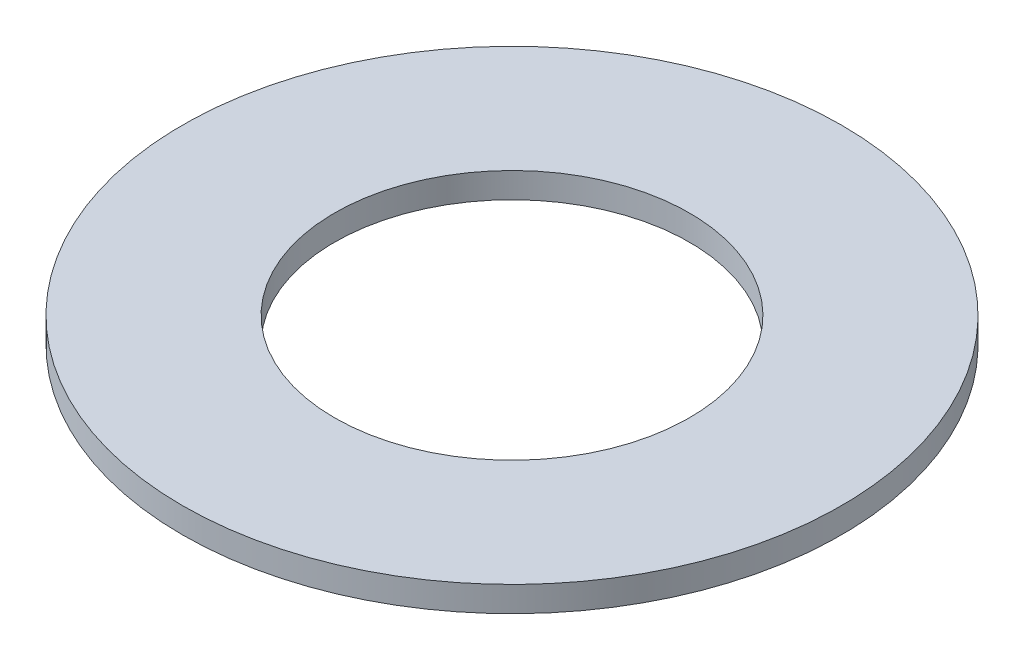
ISO-10303-21;
HEADER;
FILE_DESCRIPTION(('STEP AP214'),'2;1');
FILE_NAME('part.step','',(''),(''),'','','');
FILE_SCHEMA(('AUTOMOTIVE_DESIGN { 1 0 10303 214 1 1 1 1 }'));
ENDSEC;
DATA;
#1=APPLICATION_CONTEXT('core data for automotive mechanical design processes');
#2=APPLICATION_PROTOCOL_DEFINITION('international standard','automotive_design',2000,#1);
#3=PRODUCT_CONTEXT('',#1,'mechanical');
#4=PRODUCT('Part','Part','',(#3));
#5=PRODUCT_RELATED_PRODUCT_CATEGORY('part','',(#4));
#6=PRODUCT_DEFINITION_FORMATION('','',#4);
#7=PRODUCT_DEFINITION_CONTEXT('part definition',#1,'design');
#8=PRODUCT_DEFINITION('design','',#6,#7);
#9=PRODUCT_DEFINITION_SHAPE('','',#8);
#10=(LENGTH_UNIT() NAMED_UNIT(*) SI_UNIT(.MILLI.,.METRE.));
#11=(NAMED_UNIT(*) PLANE_ANGLE_UNIT() SI_UNIT($,.RADIAN.));
#12=(NAMED_UNIT(*) SI_UNIT($,.STERADIAN.) SOLID_ANGLE_UNIT());
#13=UNCERTAINTY_MEASURE_WITH_UNIT(LENGTH_MEASURE(1.E-05),#10,'distance_accuracy_value','');
#14=(GEOMETRIC_REPRESENTATION_CONTEXT(3) GLOBAL_UNCERTAINTY_ASSIGNED_CONTEXT((#13)) GLOBAL_UNIT_ASSIGNED_CONTEXT((#10,
#11,#12)) REPRESENTATION_CONTEXT('',''));
#15=CARTESIAN_POINT('',(0.,0.,0.));
#16=DIRECTION('',(0.,0.,1.));
#17=DIRECTION('',(1.,0.,0.));
#18=AXIS2_PLACEMENT_3D('',#15,#16,#17);
#19=CARTESIAN_POINT('',(0.,10.,0.));
#20=DIRECTION('',(0.,1.,0.));
#21=DIRECTION('',(0.,0.,1.));
#22=AXIS2_PLACEMENT_3D('',#19,#20,#21);
#23=PLANE('',#22);
#24=CARTESIAN_POINT('',(0.,10.,0.));
#25=DIRECTION('',(0.,1.,0.));
#26=DIRECTION('',(0.,0.,1.));
#27=AXIS2_PLACEMENT_3D('',#24,#25,#26);
#28=CIRCLE('',#27,130.);
#29=CARTESIAN_POINT('',(0.,10.,130.));
#30=VERTEX_POINT('',#29);
#31=EDGE_CURVE('E10',#30,#30,#28,.T.);
#32=ORIENTED_EDGE('',*,*,#31,.T.);
#33=EDGE_LOOP('',(#32));
#34=FACE_BOUND('',#33,.T.);
#35=CARTESIAN_POINT('',(0.,10.,0.));
#36=DIRECTION('',(0.,1.,0.));
#37=DIRECTION('',(0.,0.,1.));
#38=AXIS2_PLACEMENT_3D('',#35,#36,#37);
#39=CIRCLE('',#38,70.);
#40=CARTESIAN_POINT('',(0.,10.,70.));
#41=VERTEX_POINT('',#40);
#42=EDGE_CURVE('E50',#41,#41,#39,.T.);
#43=ORIENTED_EDGE('',*,*,#42,.F.);
#44=EDGE_LOOP('',(#43));
#45=FACE_BOUND('',#44,.T.);
#46=ADVANCED_FACE('F37',(#34,#45),#23,.T.);
#47=CARTESIAN_POINT('',(0.,0.,0.));
#48=DIRECTION('',(0.,1.,0.));
#49=DIRECTION('',(0.,0.,1.));
#50=AXIS2_PLACEMENT_3D('',#47,#48,#49);
#51=PLANE('',#50);
#52=CARTESIAN_POINT('',(0.,0.,0.));
#53=DIRECTION('',(0.,1.,0.));
#54=DIRECTION('',(0.,0.,1.));
#55=AXIS2_PLACEMENT_3D('',#52,#53,#54);
#56=CIRCLE('',#55,130.);
#57=CARTESIAN_POINT('',(0.,0.,130.));
#58=VERTEX_POINT('',#57);
#59=EDGE_CURVE('E41',#58,#58,#56,.T.);
#60=ORIENTED_EDGE('',*,*,#59,.F.);
#61=EDGE_LOOP('',(#60));
#62=FACE_BOUND('',#61,.T.);
#63=CARTESIAN_POINT('',(0.,0.,0.));
#64=DIRECTION('',(0.,1.,0.));
#65=DIRECTION('',(0.,0.,1.));
#66=AXIS2_PLACEMENT_3D('',#63,#64,#65);
#67=CIRCLE('',#66,70.);
#68=CARTESIAN_POINT('',(0.,0.,70.));
#69=VERTEX_POINT('',#68);
#70=EDGE_CURVE('E52',#69,#69,#67,.T.);
#71=ORIENTED_EDGE('',*,*,#70,.T.);
#72=EDGE_LOOP('',(#71));
#73=FACE_BOUND('',#72,.T.);
#74=ADVANCED_FACE('F64',(#62,#73),#51,.F.);
#75=CARTESIAN_POINT('',(0.,10.,0.));
#76=DIRECTION('',(0.,-1.,0.));
#77=DIRECTION('',(0.,0.,-1.));
#78=AXIS2_PLACEMENT_3D('',#75,#76,#77);
#79=CYLINDRICAL_SURFACE('',#78,130.);
#80=ORIENTED_EDGE('',*,*,#31,.F.);
#81=EDGE_LOOP('',(#80));
#82=FACE_BOUND('',#81,.T.);
#83=ORIENTED_EDGE('',*,*,#59,.T.);
#84=EDGE_LOOP('',(#83));
#85=FACE_BOUND('',#84,.T.);
#86=ADVANCED_FACE('F39',(#82,#85),#79,.T.);
#87=CARTESIAN_POINT('',(0.,10.,0.));
#88=DIRECTION('',(0.,-1.,0.));
#89=DIRECTION('',(0.,0.,-1.));
#90=AXIS2_PLACEMENT_3D('',#87,#88,#89);
#91=CYLINDRICAL_SURFACE('',#90,70.);
#92=ORIENTED_EDGE('',*,*,#42,.T.);
#93=EDGE_LOOP('',(#92));
#94=FACE_BOUND('',#93,.T.);
#95=ORIENTED_EDGE('',*,*,#70,.F.);
#96=EDGE_LOOP('',(#95));
#97=FACE_BOUND('',#96,.T.);
#98=ADVANCED_FACE('F60',(#94,#97),#91,.F.);
#99=CLOSED_SHELL('',(#46,#74,#86,#98));
#100=MANIFOLD_SOLID_BREP('B2',#99);
#101=ADVANCED_BREP_SHAPE_REPRESENTATION('',(#18,#100),#14);
#102=SHAPE_DEFINITION_REPRESENTATION(#9,#101);
ENDSEC;
END-ISO-10303-21;
